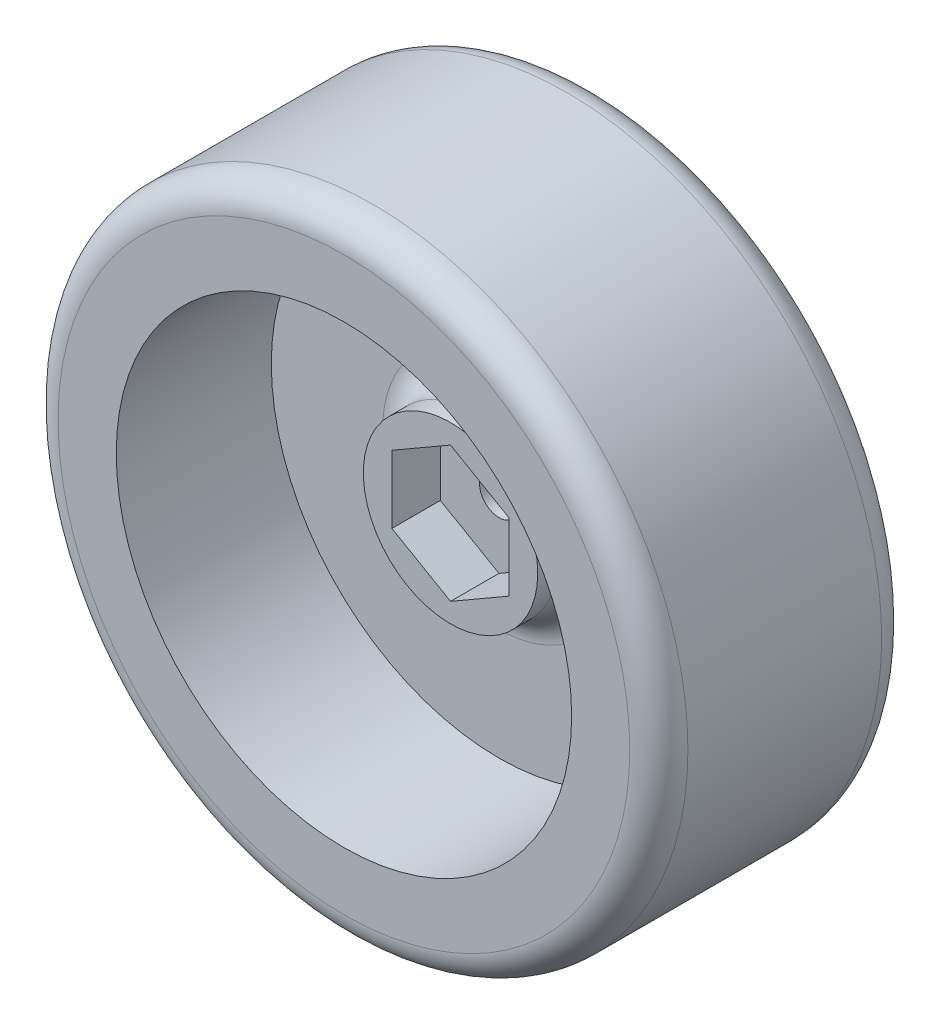
ISO-10303-21;
HEADER;
FILE_DESCRIPTION(('STEP AP214'),'2;1');
FILE_NAME('part.step','',(''),(''),'','','');
FILE_SCHEMA(('AUTOMOTIVE_DESIGN { 1 0 10303 214 1 1 1 1 }'));
ENDSEC;
DATA;
#1=APPLICATION_CONTEXT('core data for automotive mechanical design processes');
#2=APPLICATION_PROTOCOL_DEFINITION('international standard','automotive_design',2000,#1);
#3=PRODUCT_CONTEXT('',#1,'mechanical');
#4=PRODUCT('Part','Part','',(#3));
#5=PRODUCT_RELATED_PRODUCT_CATEGORY('part','',(#4));
#6=PRODUCT_DEFINITION_FORMATION('','',#4);
#7=PRODUCT_DEFINITION_CONTEXT('part definition',#1,'design');
#8=PRODUCT_DEFINITION('design','',#6,#7);
#9=PRODUCT_DEFINITION_SHAPE('','',#8);
#10=(LENGTH_UNIT() NAMED_UNIT(*) SI_UNIT(.MILLI.,.METRE.));
#11=(NAMED_UNIT(*) PLANE_ANGLE_UNIT() SI_UNIT($,.RADIAN.));
#12=(NAMED_UNIT(*) SI_UNIT($,.STERADIAN.) SOLID_ANGLE_UNIT());
#13=UNCERTAINTY_MEASURE_WITH_UNIT(LENGTH_MEASURE(1.E-05),#10,'distance_accuracy_value','');
#14=(GEOMETRIC_REPRESENTATION_CONTEXT(3) GLOBAL_UNCERTAINTY_ASSIGNED_CONTEXT((#13)) GLOBAL_UNIT_ASSIGNED_CONTEXT((#10,
#11,#12)) REPRESENTATION_CONTEXT('',''));
#15=CARTESIAN_POINT('',(0.,0.,0.));
#16=DIRECTION('',(0.,0.,1.));
#17=DIRECTION('',(1.,0.,0.));
#18=AXIS2_PLACEMENT_3D('',#15,#16,#17);
#19=CARTESIAN_POINT('',(0.,0.,26.));
#20=DIRECTION('',(0.,0.,-1.));
#21=DIRECTION('',(-1.,0.,0.));
#22=AXIS2_PLACEMENT_3D('',#19,#20,#21);
#23=CYLINDRICAL_SURFACE('',#22,2.);
#24=CARTESIAN_POINT('',(0.,0.,10.));
#25=DIRECTION('',(0.,0.,1.));
#26=DIRECTION('',(1.,0.,0.));
#27=AXIS2_PLACEMENT_3D('',#24,#25,#26);
#28=CIRCLE('',#27,2.);
#29=CARTESIAN_POINT('',(2.,0.,10.));
#30=VERTEX_POINT('',#29);
#31=EDGE_CURVE('E178',#30,#30,#28,.T.);
#32=ORIENTED_EDGE('',*,*,#31,.T.);
#33=EDGE_LOOP('',(#32));
#34=FACE_BOUND('',#33,.T.);
#35=CARTESIAN_POINT('',(0.,0.,6.));
#36=DIRECTION('',(0.,0.,-1.));
#37=DIRECTION('',(-1.,0.,0.));
#38=AXIS2_PLACEMENT_3D('',#35,#36,#37);
#39=CIRCLE('',#38,2.);
#40=CARTESIAN_POINT('',(-2.,0.,6.));
#41=VERTEX_POINT('',#40);
#42=EDGE_CURVE('E201',#41,#41,#39,.T.);
#43=ORIENTED_EDGE('',*,*,#42,.T.);
#44=EDGE_LOOP('',(#43));
#45=FACE_BOUND('',#44,.T.);
#46=ADVANCED_FACE('F45',(#34,#45),#23,.F.);
#47=CARTESIAN_POINT('',(0.,0.,10.));
#48=DIRECTION('',(0.,0.,1.));
#49=DIRECTION('',(1.,0.,0.));
#50=AXIS2_PLACEMENT_3D('',#47,#48,#49);
#51=PLANE('',#50);
#52=CARTESIAN_POINT('',(0.,0.,10.));
#53=DIRECTION('',(0.,0.,1.));
#54=DIRECTION('',(1.,0.,0.));
#55=AXIS2_PLACEMENT_3D('',#52,#53,#54);
#56=CIRCLE('',#55,12.);
#57=CARTESIAN_POINT('',(12.,0.,10.));
#58=VERTEX_POINT('',#57);
#59=EDGE_CURVE('E11',#58,#58,#56,.F.);
#60=ORIENTED_EDGE('',*,*,#59,.T.);
#61=EDGE_LOOP('',(#60));
#62=FACE_BOUND('',#61,.T.);
#63=CARTESIAN_POINT('',(0.,0.,10.));
#64=DIRECTION('',(0.,0.,1.));
#65=DIRECTION('',(1.,0.,0.));
#66=AXIS2_PLACEMENT_3D('',#63,#64,#65);
#67=CIRCLE('',#66,23.5);
#68=CARTESIAN_POINT('',(23.5,0.,10.));
#69=VERTEX_POINT('',#68);
#70=EDGE_CURVE('E174',#69,#69,#67,.T.);
#71=ORIENTED_EDGE('',*,*,#70,.T.);
#72=EDGE_LOOP('',(#71));
#73=FACE_BOUND('',#72,.T.);
#74=ADVANCED_FACE('F225',(#62,#73),#51,.T.);
#75=CARTESIAN_POINT('',(0.,0.,26.));
#76=DIRECTION('',(0.,0.,1.));
#77=DIRECTION('',(1.,0.,0.));
#78=AXIS2_PLACEMENT_3D('',#75,#76,#77);
#79=PLANE('',#78);
#80=CARTESIAN_POINT('',(0.,0.,26.));
#81=DIRECTION('',(0.,0.,1.));
#82=DIRECTION('',(1.,0.,0.));
#83=AXIS2_PLACEMENT_3D('',#80,#81,#82);
#84=CIRCLE('',#83,23.5);
#85=CARTESIAN_POINT('',(23.5,0.,26.));
#86=VERTEX_POINT('',#85);
#87=EDGE_CURVE('E173',#86,#86,#84,.T.);
#88=ORIENTED_EDGE('',*,*,#87,.F.);
#89=EDGE_LOOP('',(#88));
#90=FACE_BOUND('',#89,.T.);
#91=CARTESIAN_POINT('',(0.,0.,26.));
#92=DIRECTION('',(0.,0.,1.));
#93=DIRECTION('',(1.,0.,0.));
#94=AXIS2_PLACEMENT_3D('',#91,#92,#93);
#95=CIRCLE('',#94,29.5);
#96=CARTESIAN_POINT('',(29.5,0.,26.));
#97=VERTEX_POINT('',#96);
#98=EDGE_CURVE('E194',#97,#97,#95,.T.);
#99=ORIENTED_EDGE('',*,*,#98,.T.);
#100=EDGE_LOOP('',(#99));
#101=FACE_BOUND('',#100,.T.);
#102=ADVANCED_FACE('F233',(#90,#101),#79,.T.);
#103=CARTESIAN_POINT('',(0.,0.,0.));
#104=DIRECTION('',(0.,0.,1.));
#105=DIRECTION('',(1.,0.,0.));
#106=AXIS2_PLACEMENT_3D('',#103,#104,#105);
#107=PLANE('',#106);
#108=CARTESIAN_POINT('',(0.,0.,0.));
#109=DIRECTION('',(0.,0.,-1.));
#110=DIRECTION('',(-1.,0.,0.));
#111=AXIS2_PLACEMENT_3D('',#108,#109,#110);
#112=CIRCLE('',#111,7.5);
#113=CARTESIAN_POINT('',(-7.5,0.,0.));
#114=VERTEX_POINT('',#113);
#115=EDGE_CURVE('E204',#114,#114,#112,.T.);
#116=ORIENTED_EDGE('',*,*,#115,.F.);
#117=EDGE_LOOP('',(#116));
#118=FACE_BOUND('',#117,.T.);
#119=CARTESIAN_POINT('',(0.,0.,0.));
#120=DIRECTION('',(0.,0.,1.));
#121=DIRECTION('',(1.,0.,0.));
#122=AXIS2_PLACEMENT_3D('',#119,#120,#121);
#123=CIRCLE('',#122,29.5);
#124=CARTESIAN_POINT('',(29.5,0.,0.));
#125=VERTEX_POINT('',#124);
#126=EDGE_CURVE('E190',#125,#125,#123,.F.);
#127=ORIENTED_EDGE('',*,*,#126,.T.);
#128=EDGE_LOOP('',(#127));
#129=FACE_BOUND('',#128,.T.);
#130=ADVANCED_FACE('F243',(#118,#129),#107,.F.);
#131=CARTESIAN_POINT('',(0.,0.,26.));
#132=DIRECTION('',(0.,0.,-1.));
#133=DIRECTION('',(-1.,0.,0.));
#134=AXIS2_PLACEMENT_3D('',#131,#132,#133);
#135=CYLINDRICAL_SURFACE('',#134,32.5);
#136=CARTESIAN_POINT('',(0.,0.,3.));
#137=DIRECTION('',(0.,0.,1.));
#138=DIRECTION('',(1.,0.,0.));
#139=AXIS2_PLACEMENT_3D('',#136,#137,#138);
#140=CIRCLE('',#139,32.5);
#141=CARTESIAN_POINT('',(32.5,0.,3.));
#142=VERTEX_POINT('',#141);
#143=EDGE_CURVE('E186',#142,#142,#140,.T.);
#144=ORIENTED_EDGE('',*,*,#143,.T.);
#145=EDGE_LOOP('',(#144));
#146=FACE_BOUND('',#145,.T.);
#147=CARTESIAN_POINT('',(0.,0.,23.));
#148=DIRECTION('',(0.,0.,1.));
#149=DIRECTION('',(1.,0.,0.));
#150=AXIS2_PLACEMENT_3D('',#147,#148,#149);
#151=CIRCLE('',#150,32.5);
#152=CARTESIAN_POINT('',(32.5,0.,23.));
#153=VERTEX_POINT('',#152);
#154=EDGE_CURVE('E182',#153,#153,#151,.F.);
#155=ORIENTED_EDGE('',*,*,#154,.T.);
#156=EDGE_LOOP('',(#155));
#157=FACE_BOUND('',#156,.T.);
#158=ADVANCED_FACE('F247',(#146,#157),#135,.T.);
#159=CARTESIAN_POINT('',(0.,0.,3.));
#160=DIRECTION('',(0.,0.,1.));
#161=DIRECTION('',(1.,0.,0.));
#162=AXIS2_PLACEMENT_3D('',#159,#160,#161);
#163=TOROIDAL_SURFACE('',#162,29.5,3.);
#164=ORIENTED_EDGE('',*,*,#126,.F.);
#165=EDGE_LOOP('',(#164));
#166=FACE_BOUND('',#165,.T.);
#167=ORIENTED_EDGE('',*,*,#143,.F.);
#168=EDGE_LOOP('',(#167));
#169=FACE_BOUND('',#168,.T.);
#170=ADVANCED_FACE('F251',(#166,#169),#163,.T.);
#171=CARTESIAN_POINT('',(0.,0.,23.));
#172=DIRECTION('',(0.,0.,1.));
#173=DIRECTION('',(1.,0.,0.));
#174=AXIS2_PLACEMENT_3D('',#171,#172,#173);
#175=TOROIDAL_SURFACE('',#174,29.5,3.);
#176=ORIENTED_EDGE('',*,*,#154,.F.);
#177=EDGE_LOOP('',(#176));
#178=FACE_BOUND('',#177,.T.);
#179=ORIENTED_EDGE('',*,*,#98,.F.);
#180=EDGE_LOOP('',(#179));
#181=FACE_BOUND('',#180,.T.);
#182=ADVANCED_FACE('F254',(#178,#181),#175,.T.);
#183=CARTESIAN_POINT('',(0.,0.,10.));
#184=DIRECTION('',(0.,0.,1.));
#185=DIRECTION('',(1.,0.,0.));
#186=AXIS2_PLACEMENT_3D('',#183,#184,#185);
#187=CYLINDRICAL_SURFACE('',#186,23.5);
#188=ORIENTED_EDGE('',*,*,#70,.F.);
#189=EDGE_LOOP('',(#188));
#190=FACE_BOUND('',#189,.T.);
#191=ORIENTED_EDGE('',*,*,#87,.T.);
#192=EDGE_LOOP('',(#191));
#193=FACE_BOUND('',#192,.T.);
#194=ADVANCED_FACE('F240',(#190,#193),#187,.F.);
#195=DIRECTION('',(0.866025403784439,0.5,0.));
#196=VECTOR('',#195,1.);
#197=CARTESIAN_POINT('',(6.05,-3.49296912859724,10.));
#198=LINE('',#197,#196);
#199=CARTESIAN_POINT('',(0.,-6.98593825719447,10.));
#200=VERTEX_POINT('',#199);
#201=CARTESIAN_POINT('',(6.05,-3.49296912859724,10.));
#202=VERTEX_POINT('',#201);
#203=EDGE_CURVE('E61',#200,#202,#198,.T.);
#204=ORIENTED_EDGE('',*,*,#203,.T.);
#205=DIRECTION('',(0.,1.,0.));
#206=VECTOR('',#205,1.);
#207=CARTESIAN_POINT('',(6.05,-3.49296912859724,10.));
#208=LINE('',#207,#206);
#209=CARTESIAN_POINT('',(6.05,3.49296912859724,10.));
#210=VERTEX_POINT('',#209);
#211=EDGE_CURVE('E65',#202,#210,#208,.T.);
#212=ORIENTED_EDGE('',*,*,#211,.T.);
#213=DIRECTION('',(-0.866025403784439,0.5,0.));
#214=VECTOR('',#213,1.);
#215=CARTESIAN_POINT('',(6.05,3.49296912859724,10.));
#216=LINE('',#215,#214);
#217=CARTESIAN_POINT('',(0.,6.98593825719447,10.));
#218=VERTEX_POINT('',#217);
#219=EDGE_CURVE('E143',#210,#218,#216,.T.);
#220=ORIENTED_EDGE('',*,*,#219,.T.);
#221=DIRECTION('',(-0.866025403784439,-0.5,0.));
#222=VECTOR('',#221,1.);
#223=CARTESIAN_POINT('',(-6.05,3.49296912859724,10.));
#224=LINE('',#223,#222);
#225=CARTESIAN_POINT('',(-6.05,3.49296912859724,10.));
#226=VERTEX_POINT('',#225);
#227=EDGE_CURVE('E146',#218,#226,#224,.T.);
#228=ORIENTED_EDGE('',*,*,#227,.T.);
#229=DIRECTION('',(0.,-1.,0.));
#230=VECTOR('',#229,1.);
#231=CARTESIAN_POINT('',(-6.05,-3.49296912859724,10.));
#232=LINE('',#231,#230);
#233=CARTESIAN_POINT('',(-6.05,-3.49296912859724,10.));
#234=VERTEX_POINT('',#233);
#235=EDGE_CURVE('E149',#226,#234,#232,.T.);
#236=ORIENTED_EDGE('',*,*,#235,.T.);
#237=DIRECTION('',(0.866025403784439,-0.5,0.));
#238=VECTOR('',#237,1.);
#239=CARTESIAN_POINT('',(-6.05,-3.49296912859724,10.));
#240=LINE('',#239,#238);
#241=EDGE_CURVE('E109',#234,#200,#240,.T.);
#242=ORIENTED_EDGE('',*,*,#241,.T.);
#243=EDGE_LOOP('',(#204,#212,#220,#228,#236,#242));
#244=FACE_BOUND('',#243,.T.);
#245=ORIENTED_EDGE('',*,*,#31,.F.);
#246=EDGE_LOOP('',(#245));
#247=FACE_BOUND('',#246,.T.);
#248=ADVANCED_FACE('F236',(#244,#247),#51,.T.);
#249=CARTESIAN_POINT('',(0.,0.,15.));
#250=DIRECTION('',(0.,0.,1.));
#251=DIRECTION('',(1.,0.,0.));
#252=AXIS2_PLACEMENT_3D('',#249,#250,#251);
#253=PLANE('',#252);
#254=CARTESIAN_POINT('',(0.,0.,15.));
#255=DIRECTION('',(0.,0.,1.));
#256=DIRECTION('',(1.,0.,0.));
#257=AXIS2_PLACEMENT_3D('',#254,#255,#256);
#258=CIRCLE('',#257,9.);
#259=CARTESIAN_POINT('',(9.,0.,15.));
#260=VERTEX_POINT('',#259);
#261=EDGE_CURVE('E115',#260,#260,#258,.T.);
#262=ORIENTED_EDGE('',*,*,#261,.T.);
#263=EDGE_LOOP('',(#262));
#264=FACE_BOUND('',#263,.T.);
#265=DIRECTION('',(0.,1.,0.));
#266=VECTOR('',#265,1.);
#267=CARTESIAN_POINT('',(6.05,-3.49296912859724,15.));
#268=LINE('',#267,#266);
#269=CARTESIAN_POINT('',(6.05,-3.49296912859724,15.));
#270=VERTEX_POINT('',#269);
#271=CARTESIAN_POINT('',(6.05,3.49296912859724,15.));
#272=VERTEX_POINT('',#271);
#273=EDGE_CURVE('E108',#270,#272,#268,.T.);
#274=ORIENTED_EDGE('',*,*,#273,.F.);
#275=DIRECTION('',(0.866025403784439,0.5,0.));
#276=VECTOR('',#275,1.);
#277=CARTESIAN_POINT('',(6.05,-3.49296912859724,15.));
#278=LINE('',#277,#276);
#279=CARTESIAN_POINT('',(0.,-6.98593825719447,15.));
#280=VERTEX_POINT('',#279);
#281=EDGE_CURVE('E98',#280,#270,#278,.T.);
#282=ORIENTED_EDGE('',*,*,#281,.F.);
#283=DIRECTION('',(0.866025403784439,-0.5,0.));
#284=VECTOR('',#283,1.);
#285=CARTESIAN_POINT('',(-6.05,-3.49296912859724,15.));
#286=LINE('',#285,#284);
#287=CARTESIAN_POINT('',(-6.05,-3.49296912859724,15.));
#288=VERTEX_POINT('',#287);
#289=EDGE_CURVE('E135',#288,#280,#286,.T.);
#290=ORIENTED_EDGE('',*,*,#289,.F.);
#291=DIRECTION('',(0.,-1.,0.));
#292=VECTOR('',#291,1.);
#293=CARTESIAN_POINT('',(-6.05,-3.49296912859724,15.));
#294=LINE('',#293,#292);
#295=CARTESIAN_POINT('',(-6.05,3.49296912859724,15.));
#296=VERTEX_POINT('',#295);
#297=EDGE_CURVE('E131',#296,#288,#294,.T.);
#298=ORIENTED_EDGE('',*,*,#297,.F.);
#299=DIRECTION('',(-0.866025403784439,-0.5,0.));
#300=VECTOR('',#299,1.);
#301=CARTESIAN_POINT('',(-6.05,3.49296912859724,15.));
#302=LINE('',#301,#300);
#303=CARTESIAN_POINT('',(0.,6.98593825719447,15.));
#304=VERTEX_POINT('',#303);
#305=EDGE_CURVE('E125',#304,#296,#302,.T.);
#306=ORIENTED_EDGE('',*,*,#305,.F.);
#307=DIRECTION('',(-0.866025403784439,0.5,0.));
#308=VECTOR('',#307,1.);
#309=CARTESIAN_POINT('',(6.05,3.49296912859724,15.));
#310=LINE('',#309,#308);
#311=EDGE_CURVE('E121',#272,#304,#310,.T.);
#312=ORIENTED_EDGE('',*,*,#311,.F.);
#313=EDGE_LOOP('',(#274,#282,#290,#298,#306,#312));
#314=FACE_BOUND('',#313,.T.);
#315=ADVANCED_FACE('F119',(#264,#314),#253,.T.);
#316=CARTESIAN_POINT('',(0.,0.,15.));
#317=DIRECTION('',(0.,0.,-1.));
#318=DIRECTION('',(-1.,0.,0.));
#319=AXIS2_PLACEMENT_3D('',#316,#317,#318);
#320=CYLINDRICAL_SURFACE('',#319,9.);
#321=CARTESIAN_POINT('',(0.,0.,13.));
#322=DIRECTION('',(0.,0.,1.));
#323=DIRECTION('',(1.,0.,0.));
#324=AXIS2_PLACEMENT_3D('',#321,#322,#323);
#325=CIRCLE('',#324,9.);
#326=CARTESIAN_POINT('',(9.,0.,13.));
#327=VERTEX_POINT('',#326);
#328=EDGE_CURVE('E54',#327,#327,#325,.T.);
#329=ORIENTED_EDGE('',*,*,#328,.T.);
#330=EDGE_LOOP('',(#329));
#331=FACE_BOUND('',#330,.T.);
#332=ORIENTED_EDGE('',*,*,#261,.F.);
#333=EDGE_LOOP('',(#332));
#334=FACE_BOUND('',#333,.T.);
#335=ADVANCED_FACE('F210',(#331,#334),#320,.T.);
#336=CARTESIAN_POINT('',(6.05,-3.49296912859724,15.));
#337=DIRECTION('',(-0.5,0.866025403784439,0.));
#338=DIRECTION('',(-0.866025403784439,-0.5,0.));
#339=AXIS2_PLACEMENT_3D('',#336,#337,#338);
#340=PLANE('',#339);
#341=ORIENTED_EDGE('',*,*,#203,.F.);
#342=DIRECTION('',(0.,0.,-1.));
#343=VECTOR('',#342,1.);
#344=CARTESIAN_POINT('',(0.,-6.98593825719447,15.));
#345=LINE('',#344,#343);
#346=EDGE_CURVE('E103',#280,#200,#345,.T.);
#347=ORIENTED_EDGE('',*,*,#346,.F.);
#348=ORIENTED_EDGE('',*,*,#281,.T.);
#349=DIRECTION('',(0.,0.,-1.));
#350=VECTOR('',#349,1.);
#351=CARTESIAN_POINT('',(6.05,-3.49296912859724,15.));
#352=LINE('',#351,#350);
#353=EDGE_CURVE('E101',#270,#202,#352,.T.);
#354=ORIENTED_EDGE('',*,*,#353,.T.);
#355=EDGE_LOOP('',(#341,#347,#348,#354));
#356=FACE_BOUND('',#355,.T.);
#357=ADVANCED_FACE('F100',(#356),#340,.T.);
#358=CARTESIAN_POINT('',(6.05,-3.49296912859724,15.));
#359=DIRECTION('',(-1.,0.,0.));
#360=DIRECTION('',(0.,0.,1.));
#361=AXIS2_PLACEMENT_3D('',#358,#359,#360);
#362=PLANE('',#361);
#363=ORIENTED_EDGE('',*,*,#211,.F.);
#364=ORIENTED_EDGE('',*,*,#353,.F.);
#365=ORIENTED_EDGE('',*,*,#273,.T.);
#366=DIRECTION('',(0.,0.,-1.));
#367=VECTOR('',#366,1.);
#368=CARTESIAN_POINT('',(6.05,3.49296912859724,15.));
#369=LINE('',#368,#367);
#370=EDGE_CURVE('E116',#272,#210,#369,.T.);
#371=ORIENTED_EDGE('',*,*,#370,.T.);
#372=EDGE_LOOP('',(#363,#364,#365,#371));
#373=FACE_BOUND('',#372,.T.);
#374=ADVANCED_FACE('F112',(#373),#362,.T.);
#375=CARTESIAN_POINT('',(6.05,3.49296912859724,15.));
#376=DIRECTION('',(-0.5,-0.866025403784439,0.));
#377=DIRECTION('',(0.866025403784439,-0.5,0.));
#378=AXIS2_PLACEMENT_3D('',#375,#376,#377);
#379=PLANE('',#378);
#380=ORIENTED_EDGE('',*,*,#219,.F.);
#381=ORIENTED_EDGE('',*,*,#370,.F.);
#382=ORIENTED_EDGE('',*,*,#311,.T.);
#383=DIRECTION('',(0.,0.,-1.));
#384=VECTOR('',#383,1.);
#385=CARTESIAN_POINT('',(0.,6.98593825719447,15.));
#386=LINE('',#385,#384);
#387=EDGE_CURVE('E164',#304,#218,#386,.T.);
#388=ORIENTED_EDGE('',*,*,#387,.T.);
#389=EDGE_LOOP('',(#380,#381,#382,#388));
#390=FACE_BOUND('',#389,.T.);
#391=ADVANCED_FACE('F286',(#390),#379,.T.);
#392=CARTESIAN_POINT('',(-6.05,3.49296912859724,15.));
#393=DIRECTION('',(0.5,-0.866025403784439,0.));
#394=DIRECTION('',(0.866025403784439,0.5,0.));
#395=AXIS2_PLACEMENT_3D('',#392,#393,#394);
#396=PLANE('',#395);
#397=ORIENTED_EDGE('',*,*,#227,.F.);
#398=ORIENTED_EDGE('',*,*,#387,.F.);
#399=ORIENTED_EDGE('',*,*,#305,.T.);
#400=DIRECTION('',(0.,0.,-1.));
#401=VECTOR('',#400,1.);
#402=CARTESIAN_POINT('',(-6.05,3.49296912859724,15.));
#403=LINE('',#402,#401);
#404=EDGE_CURVE('E160',#296,#226,#403,.T.);
#405=ORIENTED_EDGE('',*,*,#404,.T.);
#406=EDGE_LOOP('',(#397,#398,#399,#405));
#407=FACE_BOUND('',#406,.T.);
#408=ADVANCED_FACE('F289',(#407),#396,.T.);
#409=CARTESIAN_POINT('',(-6.05,-3.49296912859724,15.));
#410=DIRECTION('',(1.,0.,0.));
#411=DIRECTION('',(0.,0.,-1.));
#412=AXIS2_PLACEMENT_3D('',#409,#410,#411);
#413=PLANE('',#412);
#414=ORIENTED_EDGE('',*,*,#235,.F.);
#415=ORIENTED_EDGE('',*,*,#404,.F.);
#416=ORIENTED_EDGE('',*,*,#297,.T.);
#417=DIRECTION('',(0.,0.,-1.));
#418=VECTOR('',#417,1.);
#419=CARTESIAN_POINT('',(-6.05,-3.49296912859724,15.));
#420=LINE('',#419,#418);
#421=EDGE_CURVE('E156',#288,#234,#420,.T.);
#422=ORIENTED_EDGE('',*,*,#421,.T.);
#423=EDGE_LOOP('',(#414,#415,#416,#422));
#424=FACE_BOUND('',#423,.T.);
#425=ADVANCED_FACE('F293',(#424),#413,.T.);
#426=CARTESIAN_POINT('',(-6.05,-3.49296912859724,15.));
#427=DIRECTION('',(0.5,0.866025403784439,0.));
#428=DIRECTION('',(-0.866025403784439,0.5,0.));
#429=AXIS2_PLACEMENT_3D('',#426,#427,#428);
#430=PLANE('',#429);
#431=ORIENTED_EDGE('',*,*,#241,.F.);
#432=ORIENTED_EDGE('',*,*,#421,.F.);
#433=ORIENTED_EDGE('',*,*,#289,.T.);
#434=ORIENTED_EDGE('',*,*,#346,.T.);
#435=EDGE_LOOP('',(#431,#432,#433,#434));
#436=FACE_BOUND('',#435,.T.);
#437=ADVANCED_FACE('F297',(#436),#430,.T.);
#438=CARTESIAN_POINT('',(0.,0.,2.));
#439=DIRECTION('',(0.,0.,-1.));
#440=DIRECTION('',(-1.,0.,0.));
#441=AXIS2_PLACEMENT_3D('',#438,#439,#440);
#442=CYLINDRICAL_SURFACE('',#441,7.5);
#443=CARTESIAN_POINT('',(0.,0.,2.));
#444=DIRECTION('',(0.,0.,-1.));
#445=DIRECTION('',(-1.,0.,0.));
#446=AXIS2_PLACEMENT_3D('',#443,#444,#445);
#447=CIRCLE('',#446,7.5);
#448=CARTESIAN_POINT('',(-7.5,0.,2.));
#449=VERTEX_POINT('',#448);
#450=EDGE_CURVE('E140',#449,#449,#447,.T.);
#451=ORIENTED_EDGE('',*,*,#450,.F.);
#452=EDGE_LOOP('',(#451));
#453=FACE_BOUND('',#452,.T.);
#454=ORIENTED_EDGE('',*,*,#115,.T.);
#455=EDGE_LOOP('',(#454));
#456=FACE_BOUND('',#455,.T.);
#457=ADVANCED_FACE('F301',(#453,#456),#442,.F.);
#458=CARTESIAN_POINT('',(0.,0.,2.));
#459=DIRECTION('',(0.,0.,-1.));
#460=DIRECTION('',(-1.,0.,0.));
#461=AXIS2_PLACEMENT_3D('',#458,#459,#460);
#462=PLANE('',#461);
#463=CARTESIAN_POINT('',(0.,0.,2.));
#464=DIRECTION('',(0.,0.,-1.));
#465=DIRECTION('',(-1.,0.,0.));
#466=AXIS2_PLACEMENT_3D('',#463,#464,#465);
#467=CIRCLE('',#466,5.);
#468=CARTESIAN_POINT('',(-5.,0.,2.));
#469=VERTEX_POINT('',#468);
#470=EDGE_CURVE('E317',#469,#469,#467,.T.);
#471=ORIENTED_EDGE('',*,*,#470,.F.);
#472=EDGE_LOOP('',(#471));
#473=FACE_BOUND('',#472,.T.);
#474=ORIENTED_EDGE('',*,*,#450,.T.);
#475=EDGE_LOOP('',(#474));
#476=FACE_BOUND('',#475,.T.);
#477=ADVANCED_FACE('F304',(#473,#476),#462,.T.);
#478=CARTESIAN_POINT('',(0.,0.,6.));
#479=DIRECTION('',(0.,0.,-1.));
#480=DIRECTION('',(-1.,0.,0.));
#481=AXIS2_PLACEMENT_3D('',#478,#479,#480);
#482=CYLINDRICAL_SURFACE('',#481,5.);
#483=CARTESIAN_POINT('',(0.,0.,6.));
#484=DIRECTION('',(0.,0.,-1.));
#485=DIRECTION('',(-1.,0.,0.));
#486=AXIS2_PLACEMENT_3D('',#483,#484,#485);
#487=CIRCLE('',#486,5.);
#488=CARTESIAN_POINT('',(-5.,0.,6.));
#489=VERTEX_POINT('',#488);
#490=EDGE_CURVE('E205',#489,#489,#487,.T.);
#491=ORIENTED_EDGE('',*,*,#490,.F.);
#492=EDGE_LOOP('',(#491));
#493=FACE_BOUND('',#492,.T.);
#494=ORIENTED_EDGE('',*,*,#470,.T.);
#495=EDGE_LOOP('',(#494));
#496=FACE_BOUND('',#495,.T.);
#497=ADVANCED_FACE('F220',(#493,#496),#482,.F.);
#498=CARTESIAN_POINT('',(0.,0.,6.));
#499=DIRECTION('',(0.,0.,-1.));
#500=DIRECTION('',(-1.,0.,0.));
#501=AXIS2_PLACEMENT_3D('',#498,#499,#500);
#502=PLANE('',#501);
#503=ORIENTED_EDGE('',*,*,#42,.F.);
#504=EDGE_LOOP('',(#503));
#505=FACE_BOUND('',#504,.T.);
#506=ORIENTED_EDGE('',*,*,#490,.T.);
#507=EDGE_LOOP('',(#506));
#508=FACE_BOUND('',#507,.T.);
#509=ADVANCED_FACE('F214',(#505,#508),#502,.T.);
#510=CARTESIAN_POINT('',(0.,0.,13.));
#511=DIRECTION('',(0.,0.,1.));
#512=DIRECTION('',(1.,0.,0.));
#513=AXIS2_PLACEMENT_3D('',#510,#511,#512);
#514=TOROIDAL_SURFACE('',#513,12.,3.);
#515=ORIENTED_EDGE('',*,*,#59,.F.);
#516=EDGE_LOOP('',(#515));
#517=FACE_BOUND('',#516,.T.);
#518=ORIENTED_EDGE('',*,*,#328,.F.);
#519=EDGE_LOOP('',(#518));
#520=FACE_BOUND('',#519,.T.);
#521=ADVANCED_FACE('F47',(#517,#520),#514,.F.);
#522=CLOSED_SHELL('',(#46,#74,#102,#130,#158,#170,#182,#194,#248,#315,#335,#357,#374,#391,#408,
#425,#437,#457,#477,#497,#509,#521));
#523=MANIFOLD_SOLID_BREP('B2',#522);
#524=ADVANCED_BREP_SHAPE_REPRESENTATION('',(#18,#523),#14);
#525=SHAPE_DEFINITION_REPRESENTATION(#9,#524);
ENDSEC;
END-ISO-10303-21;
